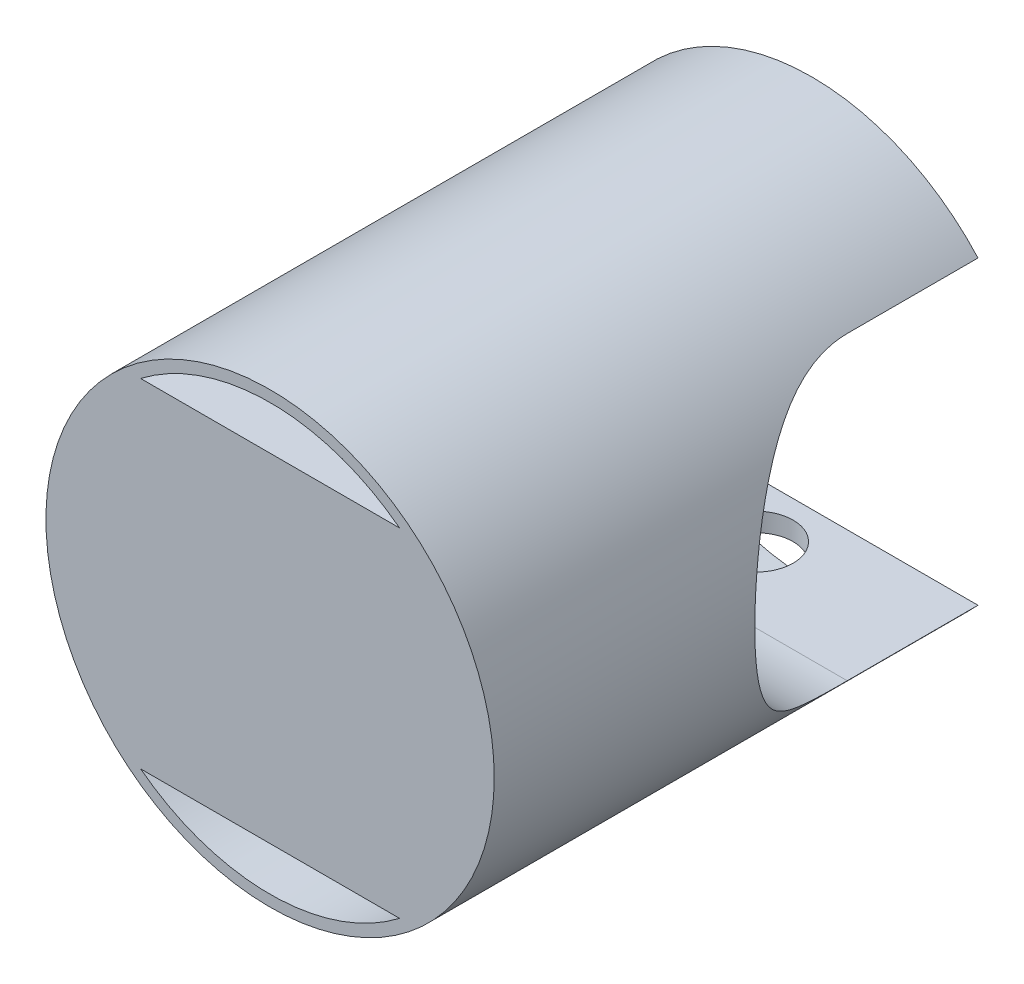
ISO-10303-21;
HEADER;
FILE_DESCRIPTION(('STEP AP214'),'2;1');
FILE_NAME('part.step','',(''),(''),'','','');
FILE_SCHEMA(('AUTOMOTIVE_DESIGN { 1 0 10303 214 1 1 1 1 }'));
ENDSEC;
DATA;
#1=APPLICATION_CONTEXT('core data for automotive mechanical design processes');
#2=APPLICATION_PROTOCOL_DEFINITION('international standard','automotive_design',2000,#1);
#3=PRODUCT_CONTEXT('',#1,'mechanical');
#4=PRODUCT('Part','Part','',(#3));
#5=PRODUCT_RELATED_PRODUCT_CATEGORY('part','',(#4));
#6=PRODUCT_DEFINITION_FORMATION('','',#4);
#7=PRODUCT_DEFINITION_CONTEXT('part definition',#1,'design');
#8=PRODUCT_DEFINITION('design','',#6,#7);
#9=PRODUCT_DEFINITION_SHAPE('','',#8);
#10=(LENGTH_UNIT() NAMED_UNIT(*) SI_UNIT(.MILLI.,.METRE.));
#11=(NAMED_UNIT(*) PLANE_ANGLE_UNIT() SI_UNIT($,.RADIAN.));
#12=(NAMED_UNIT(*) SI_UNIT($,.STERADIAN.) SOLID_ANGLE_UNIT());
#13=UNCERTAINTY_MEASURE_WITH_UNIT(LENGTH_MEASURE(1.E-05),#10,'distance_accuracy_value','');
#14=(GEOMETRIC_REPRESENTATION_CONTEXT(3) GLOBAL_UNCERTAINTY_ASSIGNED_CONTEXT((#13)) GLOBAL_UNIT_ASSIGNED_CONTEXT((#10,
#11,#12)) REPRESENTATION_CONTEXT('',''));
#15=CARTESIAN_POINT('',(0.,0.,0.));
#16=DIRECTION('',(0.,0.,1.));
#17=DIRECTION('',(1.,0.,0.));
#18=AXIS2_PLACEMENT_3D('',#15,#16,#17);
#19=CARTESIAN_POINT('',(0.,0.,0.));
#20=DIRECTION('',(0.,0.,1.));
#21=DIRECTION('',(1.,0.,0.));
#22=AXIS2_PLACEMENT_3D('',#19,#20,#21);
#23=PLANE('',#22);
#24=CARTESIAN_POINT('',(0.,0.,0.));
#25=DIRECTION('',(0.,0.,-1.));
#26=DIRECTION('',(-1.,0.,0.));
#27=AXIS2_PLACEMENT_3D('',#24,#25,#26);
#28=CIRCLE('',#27,57.);
#29=CARTESIAN_POINT('',(-34.6617584666445,45.25,0.));
#30=VERTEX_POINT('',#29);
#31=CARTESIAN_POINT('',(34.6617584666445,45.25,0.));
#32=VERTEX_POINT('',#31);
#33=EDGE_CURVE('E126',#30,#32,#28,.T.);
#34=ORIENTED_EDGE('',*,*,#33,.F.);
#35=DIRECTION('',(-1.,0.,0.));
#36=VECTOR('',#35,1.);
#37=CARTESIAN_POINT('',(34.6617584666445,45.25,0.));
#38=LINE('',#37,#36);
#39=EDGE_CURVE('E123',#32,#30,#38,.T.);
#40=ORIENTED_EDGE('',*,*,#39,.F.);
#41=EDGE_LOOP('',(#34,#40));
#42=FACE_BOUND('',#41,.T.);
#43=CARTESIAN_POINT('',(0.,0.,0.));
#44=DIRECTION('',(0.,0.,1.));
#45=DIRECTION('',(1.,0.,0.));
#46=AXIS2_PLACEMENT_3D('',#43,#44,#45);
#47=CIRCLE('',#46,60.);
#48=CARTESIAN_POINT('',(44.4964886255084,40.25,0.));
#49=VERTEX_POINT('',#48);
#50=CARTESIAN_POINT('',(-44.4964886255084,40.25,0.));
#51=VERTEX_POINT('',#50);
#52=EDGE_CURVE('E191',#49,#51,#47,.T.);
#53=ORIENTED_EDGE('',*,*,#52,.F.);
#54=DIRECTION('',(-1.,0.,0.));
#55=VECTOR('',#54,1.);
#56=CARTESIAN_POINT('',(0.,40.25,0.));
#57=LINE('',#56,#55);
#58=EDGE_CURVE('E12',#49,#51,#57,.T.);
#59=ORIENTED_EDGE('',*,*,#58,.T.);
#60=EDGE_LOOP('',(#53,#59));
#61=FACE_BOUND('',#60,.T.);
#62=ADVANCED_FACE('F37',(#42,#61),#23,.F.);
#63=CARTESIAN_POINT('',(0.,0.,145.));
#64=DIRECTION('',(0.,0.,-1.));
#65=DIRECTION('',(-1.,0.,0.));
#66=AXIS2_PLACEMENT_3D('',#63,#64,#65);
#67=CYLINDRICAL_SURFACE('',#66,60.);
#68=CARTESIAN_POINT('',(0.,0.,145.));
#69=DIRECTION('',(0.,0.,1.));
#70=DIRECTION('',(1.,0.,0.));
#71=AXIS2_PLACEMENT_3D('',#68,#69,#70);
#72=CIRCLE('',#71,60.);
#73=CARTESIAN_POINT('',(60.,0.,145.));
#74=VERTEX_POINT('',#73);
#75=EDGE_CURVE('E195',#74,#74,#72,.T.);
#76=ORIENTED_EDGE('',*,*,#75,.F.);
#77=EDGE_LOOP('',(#76));
#78=FACE_BOUND('',#77,.T.);
#79=DIRECTION('',(0.,0.,-1.));
#80=VECTOR('',#79,1.);
#81=CARTESIAN_POINT('',(44.4964886255084,-40.25,145.));
#82=LINE('',#81,#80);
#83=CARTESIAN_POINT('',(44.4964886255084,-40.25,0.));
#84=VERTEX_POINT('',#83);
#85=CARTESIAN_POINT('',(44.4964886255084,-40.25,35.));
#86=VERTEX_POINT('',#85);
#87=EDGE_CURVE('E306',#84,#86,#82,.F.);
#88=ORIENTED_EDGE('',*,*,#87,.T.);
#89=CARTESIAN_POINT('',(56.6121674200873,-19.876179210301,0.));
#90=CARTESIAN_POINT('',(56.4285483857352,-20.3991968551922,0.297017410278698));
#91=CARTESIAN_POINT('',(56.2396155302243,-20.9141095731327,0.604935251371691));
#92=CARTESIAN_POINT('',(55.8524404175049,-21.9271204918952,1.24171555344466));
#93=CARTESIAN_POINT('',(55.65419932269,-22.4252207789359,1.57057540104813));
#94=CARTESIAN_POINT('',(55.2498049085058,-23.4038294570921,2.24824785957044));
#95=CARTESIAN_POINT('',(55.0436565676444,-23.8843485568983,2.59704798153675));
#96=CARTESIAN_POINT('',(54.624665633305,-24.8276531022003,3.31402244113186));
#97=CARTESIAN_POINT('',(54.4118228127954,-25.2904379450861,3.68219743611172));
#98=CARTESIAN_POINT('',(53.7635935084474,-26.655059248488,4.81764974835915));
#99=CARTESIAN_POINT('',(53.3199898409441,-27.5296116386248,5.61339050635485));
#100=CARTESIAN_POINT('',(52.4222732479844,-29.2028640449012,7.27552297692947));
#101=CARTESIAN_POINT('',(51.9681585249434,-30.0015509656486,8.14192683910469));
#102=CARTESIAN_POINT('',(51.0620093339662,-31.5190513891649,9.94020060796596));
#103=CARTESIAN_POINT('',(50.6099726277779,-32.2380004605289,10.8719548624543));
#104=CARTESIAN_POINT('',(49.7199227474177,-33.5944542570955,12.799458866608));
#105=CARTESIAN_POINT('',(49.281910410849,-34.2319541245325,13.7952124279796));
#106=CARTESIAN_POINT('',(48.4348218081038,-35.4203268580078,15.8462722608049));
#107=CARTESIAN_POINT('',(48.0256954242742,-35.9713518979309,16.9014693752266));
#108=CARTESIAN_POINT('',(47.2513043066325,-36.9826974905988,19.0697681041894));
#109=CARTESIAN_POINT('',(46.8860224992722,-37.4430533959266,20.1828469353773));
#110=CARTESIAN_POINT('',(46.3088162617164,-38.1528680357539,22.1473432494696));
#111=CARTESIAN_POINT('',(46.082390327738,-38.4254668323672,22.986193570467));
#112=CARTESIAN_POINT('',(45.6681130138683,-38.9169221696185,24.6888234825464));
#113=CARTESIAN_POINT('',(45.4802554256875,-39.1357873607878,25.5525990358795));
#114=CARTESIAN_POINT('',(45.1497120143624,-39.5166696979882,27.2997772001098));
#115=CARTESIAN_POINT('',(45.0069588768451,-39.6787715976975,28.1831484371834));
#116=CARTESIAN_POINT('',(44.7716957220805,-39.9440466056761,29.9654034928346));
#117=CARTESIAN_POINT('',(44.6791857910996,-40.0472196127657,30.8642873380443));
#118=CARTESIAN_POINT('',(44.5479339486506,-40.1931761038563,32.6759201846978));
#119=CARTESIAN_POINT('',(44.5094910213854,-40.2356238060399,33.5887182867174));
#120=CARTESIAN_POINT('',(44.4890546779295,-40.2582198306434,35.4157232803552));
#121=CARTESIAN_POINT('',(44.5070610340189,-40.2383684043819,36.3299301662754));
#122=CARTESIAN_POINT('',(44.5987319890555,-40.1367375030638,38.1525190188344));
#123=CARTESIAN_POINT('',(44.6724256380468,-40.0549257054754,39.0608976955944));
#124=CARTESIAN_POINT('',(44.8723049283059,-39.8308754618947,40.8642608348384));
#125=CARTESIAN_POINT('',(44.9984912446347,-39.6886362387992,41.7592451249159));
#126=CARTESIAN_POINT('',(45.2881630958885,-39.3576813192131,43.4701125681586));
#127=CARTESIAN_POINT('',(45.4485611063814,-39.1727446860708,44.2872611920567));
#128=CARTESIAN_POINT('',(45.805629320023,-38.7546107784974,45.9012818571936));
#129=CARTESIAN_POINT('',(46.0023130054617,-38.5213955617508,46.6981462359757));
#130=CARTESIAN_POINT('',(46.4266025861275,-38.0089615683636,48.2689208286725));
#131=CARTESIAN_POINT('',(46.6542247797258,-37.729718527714,49.042818680277));
#132=CARTESIAN_POINT('',(47.1347802062285,-37.1276294332503,50.5650764867693));
#133=CARTESIAN_POINT('',(47.3877091108621,-36.8047908324039,51.313440779465));
#134=CARTESIAN_POINT('',(48.0361462722413,-35.9573431836533,53.125847774607));
#135=CARTESIAN_POINT('',(48.4432094611655,-35.4087750400647,54.1746405505479));
#136=CARTESIAN_POINT('',(49.2851236964855,-34.2272278496484,56.2119550238371));
#137=CARTESIAN_POINT('',(49.7199847092351,-33.5942184386857,57.2004548533129));
#138=CARTESIAN_POINT('',(50.6042954697672,-32.2467931581885,59.115969822394));
#139=CARTESIAN_POINT('',(51.0537670349988,-31.5322511307619,60.0428860676285));
#140=CARTESIAN_POINT('',(51.9540436624452,-30.0257778775863,61.8306048948545));
#141=CARTESIAN_POINT('',(52.4048485680261,-29.2338554172623,62.6914149454755));
#142=CARTESIAN_POINT('',(53.300382114869,-27.5675906984714,64.3510765149974));
#143=CARTESIAN_POINT('',(53.7450171694337,-26.6925594332889,65.1492877082238));
#144=CARTESIAN_POINT('',(54.6127497111428,-24.8689994712765,66.6702532420554));
#145=CARTESIAN_POINT('',(55.0358452850668,-23.9204642643483,67.393000885666));
#146=CARTESIAN_POINT('',(55.8491007793372,-21.9546786581219,68.756233913099));
#147=CARTESIAN_POINT('',(56.2393029534692,-20.9375195325443,69.3968254013953));
#148=CARTESIAN_POINT('',(56.9768348691476,-18.8381782880014,70.589915224687));
#149=CARTESIAN_POINT('',(57.3241775417427,-17.7560159282485,71.1424401448077));
#150=CARTESIAN_POINT('',(57.8993856284153,-15.7639460063394,72.0472188804841));
#151=CARTESIAN_POINT('',(58.1370857276616,-14.8649070676305,72.4172374477336));
#152=CARTESIAN_POINT('',(58.5747054665322,-13.0341573657777,73.0936372906333));
#153=CARTESIAN_POINT('',(58.7746258594106,-12.1024472544731,73.4000198350748));
#154=CARTESIAN_POINT('',(59.1320985026057,-10.2135639115356,73.9449583467922));
#155=CARTESIAN_POINT('',(59.2897375823867,-9.25644736958731,74.1836533767052));
#156=CARTESIAN_POINT('',(59.5596321620036,-7.32146901538629,74.5908519445067));
#157=CARTESIAN_POINT('',(59.671906462071,-6.34361597402117,74.7593845602299));
#158=CARTESIAN_POINT('',(59.8396198961242,-4.47327128093725,75.0106288446402));
#159=CARTESIAN_POINT('',(59.8996529523029,-3.58212953300829,75.1002875307769));
#160=CARTESIAN_POINT('',(59.9597986959427,-2.24121765769794,75.1900531428551));
#161=CARTESIAN_POINT('',(59.9748633180077,-1.79348565644577,75.2125212903075));
#162=CARTESIAN_POINT('',(59.9949673204824,-0.897190210079992,75.2424988353523));
#163=CARTESIAN_POINT('',(60.0000041219652,-0.448626580770983,75.2500043849062));
#164=CARTESIAN_POINT('',(59.9999907321107,1.00869883546825,75.2499901409102));
#165=CARTESIAN_POINT('',(59.9744977258412,2.01771591393388,75.2120147766894));
#166=CARTESIAN_POINT('',(59.8731219105941,4.02778392224378,75.0606576120595));
#167=CARTESIAN_POINT('',(59.7972166163742,5.02883109557833,74.9472421633002));
#168=CARTESIAN_POINT('',(59.5967069575439,7.01654212379433,74.6464698145842));
#169=CARTESIAN_POINT('',(59.4720208827635,8.00317894905509,74.4589888461132));
#170=CARTESIAN_POINT('',(59.1769314189136,9.9530488753232,74.0128142572442));
#171=CARTESIAN_POINT('',(59.0065324972522,10.9162842532722,73.7541275955454));
#172=CARTESIAN_POINT('',(58.6248745806264,12.8082198352237,73.1704974136423));
#173=CARTESIAN_POINT('',(58.4138389746482,13.7370771813097,72.8459156269149));
#174=CARTESIAN_POINT('',(57.9547317463339,15.5606317455798,72.13337652527));
#175=CARTESIAN_POINT('',(57.7066593487916,16.455328248261,71.7454178838142));
#176=CARTESIAN_POINT('',(57.1783902146085,18.206255487542,70.9101022984723));
#177=CARTESIAN_POINT('',(56.8982030845386,19.0624976209903,70.4627631109593));
#178=CARTESIAN_POINT('',(56.3107343225026,20.7336892714956,69.5123289492243));
#179=CARTESIAN_POINT('',(56.0034515488494,21.5486370463161,69.0092316253788));
#180=CARTESIAN_POINT('',(55.339859871988,23.2025899441206,67.9055225054802));
#181=CARTESIAN_POINT('',(54.9816052375558,24.0377047623741,67.3002520162886));
#182=CARTESIAN_POINT('',(54.2462694576579,25.6540590379,66.0320352504578));
#183=CARTESIAN_POINT('',(53.869187421728,26.4352959427838,65.3690862447419));
#184=CARTESIAN_POINT('',(53.1027654922072,27.9430204249937,63.987873844925));
#185=CARTESIAN_POINT('',(52.713409282677,28.669430360466,63.269534815718));
#186=CARTESIAN_POINT('',(51.9303567269628,30.0645652071697,61.7810579574388));
#187=CARTESIAN_POINT('',(51.5366601272559,30.7332867284626,61.0109170890668));
#188=CARTESIAN_POINT('',(50.6899707586675,32.1135926628626,59.2936201004385));
#189=CARTESIAN_POINT('',(50.2375784739818,32.8148921673922,58.3378667713325));
#190=CARTESIAN_POINT('',(49.3507654919571,34.1340566402087,56.3621136944447));
#191=CARTESIAN_POINT('',(48.9163489657668,34.751902318095,55.34209917228));
#192=CARTESIAN_POINT('',(48.0810240671121,35.8987142795218,53.2420993673649));
#193=CARTESIAN_POINT('',(47.6800704903505,36.4278014743569,52.1621983794437));
#194=CARTESIAN_POINT('',(46.9276354156672,37.3921279684375,49.9449350709158));
#195=CARTESIAN_POINT('',(46.5761298742497,37.827412933003,48.8076010445649));
#196=CARTESIAN_POINT('',(46.0330143829293,38.4848895520334,46.8207032080933));
#197=CARTESIAN_POINT('',(45.824670628363,38.7322039461542,45.9839590283238));
#198=CARTESIAN_POINT('',(45.4479451417036,39.173569976305,44.287705670776));
#199=CARTESIAN_POINT('',(45.2795568863143,39.3676303076192,43.4282002345989));
#200=CARTESIAN_POINT('',(44.988773903377,39.6996097860233,41.6920360725015));
#201=CARTESIAN_POINT('',(44.8663109161991,39.8376122785841,40.8154048578612));
#202=CARTESIAN_POINT('',(44.6717440824139,40.0556709645252,39.0493451459657));
#203=CARTESIAN_POINT('',(44.5996404648685,40.135726894333,38.15991659052));
#204=CARTESIAN_POINT('',(44.5086068946147,40.2366579989871,36.3710613390683));
#205=CARTESIAN_POINT('',(44.4899096571707,40.2572741721169,35.4716079794544));
#206=CARTESIAN_POINT('',(44.5071700887685,40.2381902758557,33.6738726788812));
#207=CARTESIAN_POINT('',(44.5431279202207,40.1984900272312,32.7755907414107));
#208=CARTESIAN_POINT('',(44.6681793459306,40.0594856245397,30.9868340258949));
#209=CARTESIAN_POINT('',(44.7573082820742,39.9601418261873,30.0963648406694));
#210=CARTESIAN_POINT('',(44.9850580191282,39.7035744497247,28.3302903913152));
#211=CARTESIAN_POINT('',(45.1236797326016,39.5463498043884,27.4546854015687));
#212=CARTESIAN_POINT('',(45.4375986243481,39.1851878143955,25.7644713160768));
#213=CARTESIAN_POINT('',(45.6108600828117,38.983800398457,24.9489321041998));
#214=CARTESIAN_POINT('',(45.9923562649402,38.5329768486945,23.3393373018182));
#215=CARTESIAN_POINT('',(46.2006044885673,38.2835221621961,22.5452901420682));
#216=CARTESIAN_POINT('',(46.6465472493671,37.7388851536678,20.9812592695182));
#217=CARTESIAN_POINT('',(46.8842525651651,37.4436860833858,20.211284494849));
#218=CARTESIAN_POINT('',(47.3834685809512,36.8099114721747,18.6976677574372));
#219=CARTESIAN_POINT('',(47.6449740260496,36.4713454996389,17.954020032002));
#220=CARTESIAN_POINT('',(48.2421993871414,35.6789036651363,16.3441668119744));
#221=CARTESIAN_POINT('',(48.5821333189095,35.215624777876,15.4841449721293));
#222=CARTESIAN_POINT('',(49.2804464793335,34.2315888110476,13.8054813526339));
#223=CARTESIAN_POINT('',(49.6388276507805,33.7108256708261,12.9868439494999));
#224=CARTESIAN_POINT('',(50.3662620335471,32.6139965094144,11.3922402028472));
#225=CARTESIAN_POINT('',(50.7353173943699,32.037919294464,10.6162825464959));
#226=CARTESIAN_POINT('',(51.4768371569815,30.8323873851258,9.10872826387857));
#227=CARTESIAN_POINT('',(51.8493016536865,30.2029312005154,8.37713287708736));
#228=CARTESIAN_POINT('',(52.6131068046369,28.8530357246391,6.91778434105236));
#229=CARTESIAN_POINT('',(53.0042463916249,28.1294078858464,6.19286974401079));
#230=CARTESIAN_POINT('',(53.7752669859669,26.6258249496406,4.79768629020559));
#231=CARTESIAN_POINT('',(54.1551490446836,25.8458751357781,4.12741232014419));
#232=CARTESIAN_POINT('',(54.8965718885925,24.2312869387278,2.84459518046804));
#233=CARTESIAN_POINT('',(55.2581110742959,23.3966438008034,2.23205704140582));
#234=CARTESIAN_POINT('',(55.7813572246065,22.1055690486584,1.35960159874037));
#235=CARTESIAN_POINT('',(55.952644755893,21.6685534202873,1.07642924972156));
#236=CARTESIAN_POINT('',(56.2880172824283,20.7818150728528,0.526083846266663));
#237=CARTESIAN_POINT('',(56.4521016704336,20.3320912876917,0.258912140037342));
#238=CARTESIAN_POINT('',(56.6121674200873,19.876179210301,0.));
#239=B_SPLINE_CURVE_WITH_KNOTS('',3,(#89,#90,#91,#92,#93,#94,#95,#96,#97,#98,#99,#100,#101,#102,
#103,#104,#105,#106,#107,#108,#109,#110,#111,#112,#113,#114,#115,#116,#117,#118,#119,#120,#121,
#122,#123,#124,#125,#126,#127,#128,#129,#130,#131,#132,#133,#134,#135,#136,#137,#138,#139,#140,
#141,#142,#143,#144,#145,#146,#147,#148,#149,#150,#151,#152,#153,#154,#155,#156,#157,#158,#159,
#160,#161,#162,#163,#164,#165,#166,#167,#168,#169,#170,#171,#172,#173,#174,#175,#176,#177,#178,
#179,#180,#181,#182,#183,#184,#185,#186,#187,#188,#189,#190,#191,#192,#193,#194,#195,#196,#197,
#198,#199,#200,#201,#202,#203,#204,#205,#206,#207,#208,#209,#210,#211,#212,#213,#214,#215,#216,
#217,#218,#219,#220,#221,#222,#223,#224,#225,#226,#227,#228,#229,#230,#231,#232,#233,#234,#235,
#236,#237,#238),.UNSPECIFIED.,.F.,.F.,(4,2,2,2,2,2,2,2,2,2,2,2,2,2,2,2,2,2,2,2,2,2,2,2,2,2,2,2,
2,2,2,2,2,2,2,2,2,2,2,2,2,2,2,2,2,2,2,2,2,2,2,2,2,2,2,2,2,2,2,2,2,2,2,2,2,2,2,2,2,2,2,2,2,2,4),
(0.,1.88639163071472,3.77254831606726,5.65753634154336,7.542588362214,11.3263562178152,
15.1107760198551,18.8886596720479,22.6667685384101,26.4381524750377,30.208062996645,
32.9375230906177,35.666543482372,38.3914716034885,41.1164044032357,43.856347295649,
46.596279134973,49.3376412850862,52.0790386904814,54.6356496093005,57.1932123815837,
59.7521277350511,62.3106061764641,66.0602911603202,69.8113281420049,73.5682500036802,
77.3247467847126,81.1156800771197,84.9069495095559,88.6932721333868,92.4784495861062,
95.4779615799507,98.4774137630164,101.470658231881,104.462660954394,107.152569453501,
108.497891614937,109.843559717894,112.86918037115,115.896151440069,118.928214691554,
121.959981734561,124.975535191654,127.991151775259,131.005868631639,134.020712575203,
137.293057123351,140.565556587772,143.842606600672,147.119849051535,150.921903929911,
154.724836156965,158.522545012384,162.318400848501,165.007129677999,167.695419232269,
170.379697141738,173.063987260685,175.759956308871,178.455933368288,181.153704395324,
183.851525167247,186.422235966301,188.993940985362,191.566589809358,194.138671983474,
197.238822799015,200.33930078099,203.440407526045,206.541600875652,209.827993230097,
213.114077688379,216.400448200723,218.044635099122,219.688960341598),.UNSPECIFIED.);
#240=CARTESIAN_POINT('',(44.4964886255084,40.25,35.));
#241=VERTEX_POINT('',#240);
#242=EDGE_CURVE('E150',#86,#241,#239,.T.);
#243=ORIENTED_EDGE('',*,*,#242,.T.);
#244=DIRECTION('',(0.,0.,-1.));
#245=VECTOR('',#244,1.);
#246=CARTESIAN_POINT('',(44.4964886255084,40.25,145.));
#247=LINE('',#246,#245);
#248=EDGE_CURVE('E201',#241,#49,#247,.T.);
#249=ORIENTED_EDGE('',*,*,#248,.T.);
#250=ORIENTED_EDGE('',*,*,#52,.T.);
#251=DIRECTION('',(0.,0.,-1.));
#252=VECTOR('',#251,1.);
#253=CARTESIAN_POINT('',(-44.4964886255084,40.25,145.));
#254=LINE('',#253,#252);
#255=CARTESIAN_POINT('',(-44.4964886255084,40.25,35.));
#256=VERTEX_POINT('',#255);
#257=EDGE_CURVE('E314',#51,#256,#254,.F.);
#258=ORIENTED_EDGE('',*,*,#257,.T.);
#259=CARTESIAN_POINT('',(-56.6121674200873,19.876179210301,0.));
#260=CARTESIAN_POINT('',(-56.4285483857352,20.3991968551922,0.297017410278698));
#261=CARTESIAN_POINT('',(-56.2396155302243,20.9141095731327,0.604935251371691));
#262=CARTESIAN_POINT('',(-55.8524404175049,21.9271204918952,1.24171555344466));
#263=CARTESIAN_POINT('',(-55.65419932269,22.4252207789359,1.57057540104813));
#264=CARTESIAN_POINT('',(-55.2498049085058,23.4038294570921,2.24824785957044));
#265=CARTESIAN_POINT('',(-55.0436565676444,23.8843485568983,2.59704798153675));
#266=CARTESIAN_POINT('',(-54.624665633305,24.8276531022003,3.31402244113186));
#267=CARTESIAN_POINT('',(-54.4118228127954,25.2904379450861,3.68219743611172));
#268=CARTESIAN_POINT('',(-53.7635935084474,26.655059248488,4.81764974835915));
#269=CARTESIAN_POINT('',(-53.3199898409441,27.5296116386248,5.61339050635485));
#270=CARTESIAN_POINT('',(-52.4222732479844,29.2028640449012,7.27552297692947));
#271=CARTESIAN_POINT('',(-51.9681585249434,30.0015509656486,8.14192683910469));
#272=CARTESIAN_POINT('',(-51.0620093339662,31.5190513891649,9.94020060796596));
#273=CARTESIAN_POINT('',(-50.6099726277779,32.2380004605289,10.8719548624543));
#274=CARTESIAN_POINT('',(-49.7199227474177,33.5944542570955,12.799458866608));
#275=CARTESIAN_POINT('',(-49.281910410849,34.2319541245325,13.7952124279796));
#276=CARTESIAN_POINT('',(-48.4348218081038,35.4203268580078,15.8462722608049));
#277=CARTESIAN_POINT('',(-48.0256954242742,35.9713518979309,16.9014693752266));
#278=CARTESIAN_POINT('',(-47.2513043066325,36.9826974905988,19.0697681041894));
#279=CARTESIAN_POINT('',(-46.8860224992722,37.4430533959266,20.1828469353773));
#280=CARTESIAN_POINT('',(-46.3088162617164,38.1528680357539,22.1473432494696));
#281=CARTESIAN_POINT('',(-46.082390327738,38.4254668323672,22.986193570467));
#282=CARTESIAN_POINT('',(-45.6681130138683,38.9169221696185,24.6888234825464));
#283=CARTESIAN_POINT('',(-45.4802554256875,39.1357873607878,25.5525990358795));
#284=CARTESIAN_POINT('',(-45.1497120143624,39.5166696979882,27.2997772001098));
#285=CARTESIAN_POINT('',(-45.0069588768451,39.6787715976975,28.1831484371834));
#286=CARTESIAN_POINT('',(-44.7716957220805,39.9440466056761,29.9654034928346));
#287=CARTESIAN_POINT('',(-44.6791857910996,40.0472196127657,30.8642873380443));
#288=CARTESIAN_POINT('',(-44.5479339486506,40.1931761038563,32.6759201846978));
#289=CARTESIAN_POINT('',(-44.5094910213854,40.2356238060399,33.5887182867174));
#290=CARTESIAN_POINT('',(-44.4890546779295,40.2582198306434,35.4157232803552));
#291=CARTESIAN_POINT('',(-44.5070610340189,40.2383684043819,36.3299301662754));
#292=CARTESIAN_POINT('',(-44.5987319890555,40.1367375030638,38.1525190188344));
#293=CARTESIAN_POINT('',(-44.6724256380468,40.0549257054754,39.0608976955944));
#294=CARTESIAN_POINT('',(-44.8723049283059,39.8308754618947,40.8642608348384));
#295=CARTESIAN_POINT('',(-44.9984912446347,39.6886362387992,41.7592451249159));
#296=CARTESIAN_POINT('',(-45.2881630958885,39.3576813192131,43.4701125681586));
#297=CARTESIAN_POINT('',(-45.4485611063814,39.1727446860708,44.2872611920567));
#298=CARTESIAN_POINT('',(-45.805629320023,38.7546107784974,45.9012818571936));
#299=CARTESIAN_POINT('',(-46.0023130054617,38.5213955617508,46.6981462359757));
#300=CARTESIAN_POINT('',(-46.4266025861275,38.0089615683636,48.2689208286725));
#301=CARTESIAN_POINT('',(-46.6542247797258,37.729718527714,49.042818680277));
#302=CARTESIAN_POINT('',(-47.1347802062285,37.1276294332503,50.5650764867693));
#303=CARTESIAN_POINT('',(-47.3877091108621,36.8047908324039,51.313440779465));
#304=CARTESIAN_POINT('',(-48.0361462722413,35.9573431836533,53.125847774607));
#305=CARTESIAN_POINT('',(-48.4432094611655,35.4087750400647,54.1746405505479));
#306=CARTESIAN_POINT('',(-49.2851236964855,34.2272278496484,56.2119550238371));
#307=CARTESIAN_POINT('',(-49.7199847092351,33.5942184386857,57.2004548533129));
#308=CARTESIAN_POINT('',(-50.6042954697672,32.2467931581885,59.115969822394));
#309=CARTESIAN_POINT('',(-51.0537670349988,31.5322511307619,60.0428860676285));
#310=CARTESIAN_POINT('',(-51.9540436624452,30.0257778775863,61.8306048948545));
#311=CARTESIAN_POINT('',(-52.4048485680261,29.2338554172623,62.6914149454755));
#312=CARTESIAN_POINT('',(-53.300382114869,27.5675906984714,64.3510765149974));
#313=CARTESIAN_POINT('',(-53.7450171694337,26.6925594332889,65.1492877082238));
#314=CARTESIAN_POINT('',(-54.6127497111428,24.8689994712765,66.6702532420554));
#315=CARTESIAN_POINT('',(-55.0358452850668,23.9204642643483,67.393000885666));
#316=CARTESIAN_POINT('',(-55.8491007793372,21.9546786581219,68.756233913099));
#317=CARTESIAN_POINT('',(-56.2393029534692,20.9375195325443,69.3968254013953));
#318=CARTESIAN_POINT('',(-56.9768348691476,18.8381782880014,70.589915224687));
#319=CARTESIAN_POINT('',(-57.3241775417427,17.7560159282485,71.1424401448077));
#320=CARTESIAN_POINT('',(-57.8993856284153,15.7639460063394,72.0472188804841));
#321=CARTESIAN_POINT('',(-58.1370857276616,14.8649070676305,72.4172374477336));
#322=CARTESIAN_POINT('',(-58.5747054665322,13.0341573657777,73.0936372906333));
#323=CARTESIAN_POINT('',(-58.7746258594106,12.1024472544731,73.4000198350748));
#324=CARTESIAN_POINT('',(-59.1320985026057,10.2135639115356,73.9449583467922));
#325=CARTESIAN_POINT('',(-59.2897375823867,9.25644736958731,74.1836533767052));
#326=CARTESIAN_POINT('',(-59.5596321620036,7.32146901538629,74.5908519445067));
#327=CARTESIAN_POINT('',(-59.671906462071,6.34361597402117,74.7593845602299));
#328=CARTESIAN_POINT('',(-59.8396198961242,4.47327128093725,75.0106288446402));
#329=CARTESIAN_POINT('',(-59.8996529523029,3.58212953300829,75.1002875307769));
#330=CARTESIAN_POINT('',(-59.9597986959427,2.24121765769794,75.1900531428551));
#331=CARTESIAN_POINT('',(-59.9748633180077,1.79348565644577,75.2125212903075));
#332=CARTESIAN_POINT('',(-59.9949673204824,0.897190210079992,75.2424988353523));
#333=CARTESIAN_POINT('',(-60.0000041219652,0.448626580770983,75.2500043849062));
#334=CARTESIAN_POINT('',(-59.9999907321107,-1.00869883546825,75.2499901409102));
#335=CARTESIAN_POINT('',(-59.9744977258412,-2.01771591393388,75.2120147766894));
#336=CARTESIAN_POINT('',(-59.8731219105941,-4.02778392224378,75.0606576120595));
#337=CARTESIAN_POINT('',(-59.7972166163742,-5.02883109557833,74.9472421633002));
#338=CARTESIAN_POINT('',(-59.5967069575439,-7.01654212379433,74.6464698145842));
#339=CARTESIAN_POINT('',(-59.4720208827635,-8.00317894905509,74.4589888461132));
#340=CARTESIAN_POINT('',(-59.1769314189136,-9.9530488753232,74.0128142572442));
#341=CARTESIAN_POINT('',(-59.0065324972522,-10.9162842532722,73.7541275955454));
#342=CARTESIAN_POINT('',(-58.6248745806264,-12.8082198352237,73.1704974136423));
#343=CARTESIAN_POINT('',(-58.4138389746482,-13.7370771813097,72.8459156269149));
#344=CARTESIAN_POINT('',(-57.9547317463339,-15.5606317455798,72.13337652527));
#345=CARTESIAN_POINT('',(-57.7066593487916,-16.455328248261,71.7454178838142));
#346=CARTESIAN_POINT('',(-57.1783902146085,-18.206255487542,70.9101022984723));
#347=CARTESIAN_POINT('',(-56.8982030845386,-19.0624976209903,70.4627631109593));
#348=CARTESIAN_POINT('',(-56.3107343225026,-20.7336892714956,69.5123289492243));
#349=CARTESIAN_POINT('',(-56.0034515488494,-21.5486370463161,69.0092316253788));
#350=CARTESIAN_POINT('',(-55.339859871988,-23.2025899441206,67.9055225054802));
#351=CARTESIAN_POINT('',(-54.9816052375558,-24.0377047623741,67.3002520162886));
#352=CARTESIAN_POINT('',(-54.2462694576579,-25.6540590379,66.0320352504578));
#353=CARTESIAN_POINT('',(-53.869187421728,-26.4352959427838,65.3690862447419));
#354=CARTESIAN_POINT('',(-53.1027654922072,-27.9430204249937,63.987873844925));
#355=CARTESIAN_POINT('',(-52.713409282677,-28.669430360466,63.269534815718));
#356=CARTESIAN_POINT('',(-51.9303567269628,-30.0645652071697,61.7810579574388));
#357=CARTESIAN_POINT('',(-51.5366601272559,-30.7332867284626,61.0109170890668));
#358=CARTESIAN_POINT('',(-50.6899707586675,-32.1135926628626,59.2936201004385));
#359=CARTESIAN_POINT('',(-50.2375784739818,-32.8148921673922,58.3378667713325));
#360=CARTESIAN_POINT('',(-49.3507654919571,-34.1340566402087,56.3621136944447));
#361=CARTESIAN_POINT('',(-48.9163489657668,-34.751902318095,55.34209917228));
#362=CARTESIAN_POINT('',(-48.0810240671121,-35.8987142795218,53.2420993673649));
#363=CARTESIAN_POINT('',(-47.6800704903505,-36.4278014743569,52.1621983794437));
#364=CARTESIAN_POINT('',(-46.9276354156672,-37.3921279684375,49.9449350709158));
#365=CARTESIAN_POINT('',(-46.5761298742497,-37.827412933003,48.8076010445649));
#366=CARTESIAN_POINT('',(-46.0330143829293,-38.4848895520334,46.8207032080933));
#367=CARTESIAN_POINT('',(-45.824670628363,-38.7322039461542,45.9839590283238));
#368=CARTESIAN_POINT('',(-45.4479451417036,-39.173569976305,44.287705670776));
#369=CARTESIAN_POINT('',(-45.2795568863143,-39.3676303076192,43.4282002345989));
#370=CARTESIAN_POINT('',(-44.988773903377,-39.6996097860233,41.6920360725015));
#371=CARTESIAN_POINT('',(-44.8663109161991,-39.8376122785841,40.8154048578612));
#372=CARTESIAN_POINT('',(-44.6717440824139,-40.0556709645252,39.0493451459657));
#373=CARTESIAN_POINT('',(-44.5996404648685,-40.135726894333,38.15991659052));
#374=CARTESIAN_POINT('',(-44.5086068946147,-40.2366579989871,36.3710613390683));
#375=CARTESIAN_POINT('',(-44.4899096571707,-40.2572741721169,35.4716079794544));
#376=CARTESIAN_POINT('',(-44.5071700887685,-40.2381902758557,33.6738726788812));
#377=CARTESIAN_POINT('',(-44.5431279202207,-40.1984900272312,32.7755907414107));
#378=CARTESIAN_POINT('',(-44.6681793459306,-40.0594856245397,30.9868340258949));
#379=CARTESIAN_POINT('',(-44.7573082820742,-39.9601418261873,30.0963648406694));
#380=CARTESIAN_POINT('',(-44.9850580191282,-39.7035744497247,28.3302903913152));
#381=CARTESIAN_POINT('',(-45.1236797326016,-39.5463498043884,27.4546854015687));
#382=CARTESIAN_POINT('',(-45.4375986243481,-39.1851878143955,25.7644713160768));
#383=CARTESIAN_POINT('',(-45.6108600828117,-38.983800398457,24.9489321041998));
#384=CARTESIAN_POINT('',(-45.9923562649402,-38.5329768486945,23.3393373018182));
#385=CARTESIAN_POINT('',(-46.2006044885673,-38.2835221621961,22.5452901420682));
#386=CARTESIAN_POINT('',(-46.6465472493671,-37.7388851536678,20.9812592695182));
#387=CARTESIAN_POINT('',(-46.8842525651651,-37.4436860833858,20.211284494849));
#388=CARTESIAN_POINT('',(-47.3834685809512,-36.8099114721747,18.6976677574372));
#389=CARTESIAN_POINT('',(-47.6449740260496,-36.4713454996389,17.954020032002));
#390=CARTESIAN_POINT('',(-48.2421993871414,-35.6789036651363,16.3441668119744));
#391=CARTESIAN_POINT('',(-48.5821333189095,-35.215624777876,15.4841449721293));
#392=CARTESIAN_POINT('',(-49.2804464793335,-34.2315888110476,13.8054813526339));
#393=CARTESIAN_POINT('',(-49.6388276507805,-33.7108256708261,12.9868439494999));
#394=CARTESIAN_POINT('',(-50.3662620335471,-32.6139965094144,11.3922402028472));
#395=CARTESIAN_POINT('',(-50.7353173943699,-32.037919294464,10.6162825464959));
#396=CARTESIAN_POINT('',(-51.4768371569815,-30.8323873851258,9.10872826387857));
#397=CARTESIAN_POINT('',(-51.8493016536865,-30.2029312005154,8.37713287708736));
#398=CARTESIAN_POINT('',(-52.6131068046369,-28.8530357246391,6.91778434105236));
#399=CARTESIAN_POINT('',(-53.0042463916249,-28.1294078858464,6.19286974401079));
#400=CARTESIAN_POINT('',(-53.7752669859669,-26.6258249496406,4.79768629020559));
#401=CARTESIAN_POINT('',(-54.1551490446836,-25.8458751357781,4.12741232014419));
#402=CARTESIAN_POINT('',(-54.8965718885925,-24.2312869387278,2.84459518046804));
#403=CARTESIAN_POINT('',(-55.2581110742959,-23.3966438008034,2.23205704140582));
#404=CARTESIAN_POINT('',(-55.7813572246065,-22.1055690486584,1.35960159874037));
#405=CARTESIAN_POINT('',(-55.952644755893,-21.6685534202873,1.07642924972156));
#406=CARTESIAN_POINT('',(-56.2880172824283,-20.7818150728528,0.526083846266663));
#407=CARTESIAN_POINT('',(-56.4521016704336,-20.3320912876917,0.258912140037342));
#408=CARTESIAN_POINT('',(-56.6121674200873,-19.876179210301,0.));
#409=B_SPLINE_CURVE_WITH_KNOTS('',3,(#259,#260,#261,#262,#263,#264,#265,#266,#267,#268,#269,
#270,#271,#272,#273,#274,#275,#276,#277,#278,#279,#280,#281,#282,#283,#284,#285,#286,#287,#288,
#289,#290,#291,#292,#293,#294,#295,#296,#297,#298,#299,#300,#301,#302,#303,#304,#305,#306,#307,
#308,#309,#310,#311,#312,#313,#314,#315,#316,#317,#318,#319,#320,#321,#322,#323,#324,#325,#326,
#327,#328,#329,#330,#331,#332,#333,#334,#335,#336,#337,#338,#339,#340,#341,#342,#343,#344,#345,
#346,#347,#348,#349,#350,#351,#352,#353,#354,#355,#356,#357,#358,#359,#360,#361,#362,#363,#364,
#365,#366,#367,#368,#369,#370,#371,#372,#373,#374,#375,#376,#377,#378,#379,#380,#381,#382,#383,
#384,#385,#386,#387,#388,#389,#390,#391,#392,#393,#394,#395,#396,#397,#398,#399,#400,#401,#402,
#403,#404,#405,#406,#407,#408),.UNSPECIFIED.,.F.,.F.,(4,2,2,2,2,2,2,2,2,2,2,2,2,2,2,2,2,2,2,2,2,
2,2,2,2,2,2,2,2,2,2,2,2,2,2,2,2,2,2,2,2,2,2,2,2,2,2,2,2,2,2,2,2,2,2,2,2,2,2,2,2,2,2,2,2,2,2,2,2,
2,2,2,2,2,4),(0.,1.88639163071472,3.77254831606726,5.65753634154336,7.542588362214,
11.3263562178152,15.1107760198551,18.8886596720479,22.6667685384101,26.4381524750377,
30.208062996645,32.9375230906177,35.666543482372,38.3914716034885,41.1164044032357,
43.856347295649,46.596279134973,49.3376412850862,52.0790386904814,54.6356496093005,
57.1932123815837,59.7521277350511,62.3106061764641,66.0602911603202,69.8113281420049,
73.5682500036802,77.3247467847126,81.1156800771197,84.9069495095559,88.6932721333868,
92.4784495861062,95.4779615799507,98.4774137630164,101.470658231881,104.462660954394,
107.152569453501,108.497891614937,109.843559717894,112.86918037115,115.896151440069,
118.928214691554,121.959981734561,124.975535191654,127.991151775259,131.005868631639,
134.020712575203,137.293057123351,140.565556587772,143.842606600672,147.119849051535,
150.921903929911,154.724836156965,158.522545012384,162.318400848501,165.007129677999,
167.695419232269,170.379697141738,173.063987260685,175.759956308871,178.455933368288,
181.153704395324,183.851525167247,186.422235966301,188.993940985362,191.566589809358,
194.138671983474,197.238822799015,200.33930078099,203.440407526045,206.541600875652,
209.827993230097,213.114077688379,216.400448200723,218.044635099122,219.688960341598),.UNSPECIFIED.);
#410=CARTESIAN_POINT('',(-44.4964886255084,-40.25,35.));
#411=VERTEX_POINT('',#410);
#412=EDGE_CURVE('E143',#256,#411,#409,.T.);
#413=ORIENTED_EDGE('',*,*,#412,.T.);
#414=DIRECTION('',(0.,0.,-1.));
#415=VECTOR('',#414,1.);
#416=CARTESIAN_POINT('',(-44.4964886255084,-40.25,145.));
#417=LINE('',#416,#415);
#418=CARTESIAN_POINT('',(-44.4964886255084,-40.25,0.));
#419=VERTEX_POINT('',#418);
#420=EDGE_CURVE('E308',#411,#419,#417,.T.);
#421=ORIENTED_EDGE('',*,*,#420,.T.);
#422=EDGE_CURVE('E196',#419,#84,#47,.T.);
#423=ORIENTED_EDGE('',*,*,#422,.T.);
#424=EDGE_LOOP('',(#88,#243,#249,#250,#258,#413,#421,#423));
#425=FACE_BOUND('',#424,.T.);
#426=ADVANCED_FACE('F39',(#78,#425),#67,.T.);
#427=CARTESIAN_POINT('',(0.,0.,145.));
#428=DIRECTION('',(0.,0.,1.));
#429=DIRECTION('',(1.,0.,0.));
#430=AXIS2_PLACEMENT_3D('',#427,#428,#429);
#431=PLANE('',#430);
#432=DIRECTION('',(1.,0.,0.));
#433=VECTOR('',#432,1.);
#434=CARTESIAN_POINT('',(34.6617584666445,-45.25,145.));
#435=LINE('',#434,#433);
#436=CARTESIAN_POINT('',(-34.6617584666445,-45.25,145.));
#437=VERTEX_POINT('',#436);
#438=CARTESIAN_POINT('',(34.6617584666445,-45.25,145.));
#439=VERTEX_POINT('',#438);
#440=EDGE_CURVE('E113',#437,#439,#435,.T.);
#441=ORIENTED_EDGE('',*,*,#440,.T.);
#442=CARTESIAN_POINT('',(0.,0.,145.));
#443=DIRECTION('',(0.,0.,1.));
#444=DIRECTION('',(1.,0.,0.));
#445=AXIS2_PLACEMENT_3D('',#442,#443,#444);
#446=CIRCLE('',#445,57.);
#447=EDGE_CURVE('E104',#439,#437,#446,.F.);
#448=ORIENTED_EDGE('',*,*,#447,.T.);
#449=EDGE_LOOP('',(#441,#448));
#450=FACE_BOUND('',#449,.T.);
#451=DIRECTION('',(-1.,0.,0.));
#452=VECTOR('',#451,1.);
#453=CARTESIAN_POINT('',(34.6617584666445,45.25,145.));
#454=LINE('',#453,#452);
#455=CARTESIAN_POINT('',(34.6617584666445,45.25,145.));
#456=VERTEX_POINT('',#455);
#457=CARTESIAN_POINT('',(-34.6617584666445,45.25,145.));
#458=VERTEX_POINT('',#457);
#459=EDGE_CURVE('E125',#456,#458,#454,.T.);
#460=ORIENTED_EDGE('',*,*,#459,.T.);
#461=CARTESIAN_POINT('',(0.,0.,145.));
#462=DIRECTION('',(0.,0.,1.));
#463=DIRECTION('',(1.,0.,0.));
#464=AXIS2_PLACEMENT_3D('',#461,#462,#463);
#465=CIRCLE('',#464,57.);
#466=EDGE_CURVE('E132',#458,#456,#465,.F.);
#467=ORIENTED_EDGE('',*,*,#466,.T.);
#468=EDGE_LOOP('',(#460,#467));
#469=FACE_BOUND('',#468,.T.);
#470=ORIENTED_EDGE('',*,*,#75,.T.);
#471=EDGE_LOOP('',(#470));
#472=FACE_BOUND('',#471,.T.);
#473=ADVANCED_FACE('F115',(#450,#469,#472),#431,.T.);
#474=CARTESIAN_POINT('',(0.,0.,0.));
#475=DIRECTION('',(0.,0.,-1.));
#476=DIRECTION('',(-1.,0.,0.));
#477=AXIS2_PLACEMENT_3D('',#474,#475,#476);
#478=CIRCLE('',#477,57.);
#479=CARTESIAN_POINT('',(34.6617584666445,-45.25,0.));
#480=VERTEX_POINT('',#479);
#481=CARTESIAN_POINT('',(-34.6617584666445,-45.25,0.));
#482=VERTEX_POINT('',#481);
#483=EDGE_CURVE('E118',#480,#482,#478,.T.);
#484=ORIENTED_EDGE('',*,*,#483,.F.);
#485=DIRECTION('',(1.,0.,0.));
#486=VECTOR('',#485,1.);
#487=CARTESIAN_POINT('',(34.6617584666445,-45.25,0.));
#488=LINE('',#487,#486);
#489=EDGE_CURVE('E62',#482,#480,#488,.T.);
#490=ORIENTED_EDGE('',*,*,#489,.F.);
#491=EDGE_LOOP('',(#484,#490));
#492=FACE_BOUND('',#491,.T.);
#493=ORIENTED_EDGE('',*,*,#422,.F.);
#494=DIRECTION('',(1.,0.,0.));
#495=VECTOR('',#494,1.);
#496=CARTESIAN_POINT('',(0.,-40.25,0.));
#497=LINE('',#496,#495);
#498=EDGE_CURVE('E47',#419,#84,#497,.T.);
#499=ORIENTED_EDGE('',*,*,#498,.T.);
#500=EDGE_LOOP('',(#493,#499));
#501=FACE_BOUND('',#500,.T.);
#502=ADVANCED_FACE('F169',(#492,#501),#23,.F.);
#503=CARTESIAN_POINT('',(-60.,40.25,35.));
#504=DIRECTION('',(0.,1.,0.));
#505=DIRECTION('',(0.,0.,1.));
#506=AXIS2_PLACEMENT_3D('',#503,#504,#505);
#507=PLANE('',#506);
#508=CARTESIAN_POINT('',(0.,40.25,15.));
#509=DIRECTION('',(0.,1.,0.));
#510=DIRECTION('',(0.,0.,1.));
#511=AXIS2_PLACEMENT_3D('',#508,#509,#510);
#512=CIRCLE('',#511,10.);
#513=CARTESIAN_POINT('',(0.,40.25,25.));
#514=VERTEX_POINT('',#513);
#515=EDGE_CURVE('E140',#514,#514,#512,.T.);
#516=ORIENTED_EDGE('',*,*,#515,.T.);
#517=EDGE_LOOP('',(#516));
#518=FACE_BOUND('',#517,.T.);
#519=DIRECTION('',(1.,0.,0.));
#520=VECTOR('',#519,1.);
#521=CARTESIAN_POINT('',(-60.,40.25,35.));
#522=LINE('',#521,#520);
#523=EDGE_CURVE('E309',#256,#241,#522,.T.);
#524=ORIENTED_EDGE('',*,*,#523,.F.);
#525=ORIENTED_EDGE('',*,*,#257,.F.);
#526=ORIENTED_EDGE('',*,*,#58,.F.);
#527=ORIENTED_EDGE('',*,*,#248,.F.);
#528=EDGE_LOOP('',(#524,#525,#526,#527));
#529=FACE_BOUND('',#528,.T.);
#530=ADVANCED_FACE('F165',(#518,#529),#507,.F.);
#531=CARTESIAN_POINT('',(-60.,-40.25,35.));
#532=DIRECTION('',(0.,-1.,0.));
#533=DIRECTION('',(0.,0.,-1.));
#534=AXIS2_PLACEMENT_3D('',#531,#532,#533);
#535=PLANE('',#534);
#536=CARTESIAN_POINT('',(0.,-40.25,15.));
#537=DIRECTION('',(0.,-1.,0.));
#538=DIRECTION('',(0.,0.,-1.));
#539=AXIS2_PLACEMENT_3D('',#536,#537,#538);
#540=CIRCLE('',#539,10.);
#541=CARTESIAN_POINT('',(0.,-40.25,5.));
#542=VERTEX_POINT('',#541);
#543=EDGE_CURVE('E144',#542,#542,#540,.T.);
#544=ORIENTED_EDGE('',*,*,#543,.T.);
#545=EDGE_LOOP('',(#544));
#546=FACE_BOUND('',#545,.T.);
#547=DIRECTION('',(1.,0.,0.));
#548=VECTOR('',#547,1.);
#549=CARTESIAN_POINT('',(-60.,-40.25,35.));
#550=LINE('',#549,#548);
#551=EDGE_CURVE('E304',#411,#86,#550,.T.);
#552=ORIENTED_EDGE('',*,*,#551,.T.);
#553=ORIENTED_EDGE('',*,*,#87,.F.);
#554=ORIENTED_EDGE('',*,*,#498,.F.);
#555=ORIENTED_EDGE('',*,*,#420,.F.);
#556=EDGE_LOOP('',(#552,#553,#554,#555));
#557=FACE_BOUND('',#556,.T.);
#558=ADVANCED_FACE('F161',(#546,#557),#535,.F.);
#559=CARTESIAN_POINT('',(60.,0.,35.));
#560=DIRECTION('',(-1.,0.,0.));
#561=DIRECTION('',(0.,0.,1.));
#562=AXIS2_PLACEMENT_3D('',#559,#560,#561);
#563=CYLINDRICAL_SURFACE('',#562,40.25);
#564=ORIENTED_EDGE('',*,*,#242,.F.);
#565=ORIENTED_EDGE('',*,*,#551,.F.);
#566=ORIENTED_EDGE('',*,*,#412,.F.);
#567=ORIENTED_EDGE('',*,*,#523,.T.);
#568=EDGE_LOOP('',(#564,#565,#566,#567));
#569=FACE_BOUND('',#568,.T.);
#570=ADVANCED_FACE('F155',(#569),#563,.F.);
#571=CARTESIAN_POINT('',(0.,-70.001,15.));
#572=DIRECTION('',(0.,1.,0.));
#573=DIRECTION('',(0.,0.,1.));
#574=AXIS2_PLACEMENT_3D('',#571,#572,#573);
#575=CYLINDRICAL_SURFACE('',#574,10.);
#576=CARTESIAN_POINT('',(0.,-45.25,15.));
#577=DIRECTION('',(0.,1.,0.));
#578=DIRECTION('',(0.,0.,1.));
#579=AXIS2_PLACEMENT_3D('',#576,#577,#578);
#580=CIRCLE('',#579,10.);
#581=CARTESIAN_POINT('',(0.,-45.25,25.));
#582=VERTEX_POINT('',#581);
#583=EDGE_CURVE('E42',#582,#582,#580,.F.);
#584=ORIENTED_EDGE('',*,*,#583,.T.);
#585=EDGE_LOOP('',(#584));
#586=FACE_BOUND('',#585,.T.);
#587=ORIENTED_EDGE('',*,*,#543,.F.);
#588=EDGE_LOOP('',(#587));
#589=FACE_BOUND('',#588,.T.);
#590=ADVANCED_FACE('F160',(#586,#589),#575,.F.);
#591=CARTESIAN_POINT('',(0.,45.25,15.));
#592=DIRECTION('',(0.,-1.,0.));
#593=DIRECTION('',(0.,0.,-1.));
#594=AXIS2_PLACEMENT_3D('',#591,#592,#593);
#595=CIRCLE('',#594,10.);
#596=CARTESIAN_POINT('',(0.,45.25,5.));
#597=VERTEX_POINT('',#596);
#598=EDGE_CURVE('E139',#597,#597,#595,.F.);
#599=ORIENTED_EDGE('',*,*,#598,.T.);
#600=EDGE_LOOP('',(#599));
#601=FACE_BOUND('',#600,.T.);
#602=ORIENTED_EDGE('',*,*,#515,.F.);
#603=EDGE_LOOP('',(#602));
#604=FACE_BOUND('',#603,.T.);
#605=ADVANCED_FACE('F163',(#601,#604),#575,.F.);
#606=CARTESIAN_POINT('',(34.6617584666445,45.25,215.312249999556));
#607=DIRECTION('',(0.,-1.,0.));
#608=DIRECTION('',(0.,0.,-1.));
#609=AXIS2_PLACEMENT_3D('',#606,#607,#608);
#610=PLANE('',#609);
#611=DIRECTION('',(0.,0.,-1.));
#612=VECTOR('',#611,1.);
#613=CARTESIAN_POINT('',(34.6617584666445,45.25,215.312249999556));
#614=LINE('',#613,#612);
#615=EDGE_CURVE('E135',#456,#32,#614,.T.);
#616=ORIENTED_EDGE('',*,*,#615,.T.);
#617=ORIENTED_EDGE('',*,*,#39,.T.);
#618=DIRECTION('',(0.,0.,-1.));
#619=VECTOR('',#618,1.);
#620=CARTESIAN_POINT('',(-34.6617584666445,45.25,215.312249999556));
#621=LINE('',#620,#619);
#622=EDGE_CURVE('E131',#458,#30,#621,.T.);
#623=ORIENTED_EDGE('',*,*,#622,.F.);
#624=ORIENTED_EDGE('',*,*,#459,.F.);
#625=EDGE_LOOP('',(#616,#617,#623,#624));
#626=FACE_BOUND('',#625,.T.);
#627=ORIENTED_EDGE('',*,*,#598,.F.);
#628=EDGE_LOOP('',(#627));
#629=FACE_BOUND('',#628,.T.);
#630=ADVANCED_FACE('F212',(#626,#629),#610,.F.);
#631=CARTESIAN_POINT('',(0.,0.,215.312249999556));
#632=DIRECTION('',(0.,0.,-1.));
#633=DIRECTION('',(-1.,0.,0.));
#634=AXIS2_PLACEMENT_3D('',#631,#632,#633);
#635=CYLINDRICAL_SURFACE('',#634,57.);
#636=ORIENTED_EDGE('',*,*,#622,.T.);
#637=ORIENTED_EDGE('',*,*,#33,.T.);
#638=ORIENTED_EDGE('',*,*,#615,.F.);
#639=ORIENTED_EDGE('',*,*,#466,.F.);
#640=EDGE_LOOP('',(#636,#637,#638,#639));
#641=FACE_BOUND('',#640,.T.);
#642=ADVANCED_FACE('F214',(#641),#635,.F.);
#643=CARTESIAN_POINT('',(34.6617584666445,-45.25,215.312249999556));
#644=DIRECTION('',(0.,1.,0.));
#645=DIRECTION('',(0.,0.,1.));
#646=AXIS2_PLACEMENT_3D('',#643,#644,#645);
#647=PLANE('',#646);
#648=DIRECTION('',(0.,0.,-1.));
#649=VECTOR('',#648,1.);
#650=CARTESIAN_POINT('',(-34.6617584666445,-45.25,215.312249999556));
#651=LINE('',#650,#649);
#652=EDGE_CURVE('E55',#437,#482,#651,.T.);
#653=ORIENTED_EDGE('',*,*,#652,.T.);
#654=ORIENTED_EDGE('',*,*,#489,.T.);
#655=DIRECTION('',(0.,0.,-1.));
#656=VECTOR('',#655,1.);
#657=CARTESIAN_POINT('',(34.6617584666445,-45.25,215.312249999556));
#658=LINE('',#657,#656);
#659=EDGE_CURVE('E106',#439,#480,#658,.T.);
#660=ORIENTED_EDGE('',*,*,#659,.F.);
#661=ORIENTED_EDGE('',*,*,#440,.F.);
#662=EDGE_LOOP('',(#653,#654,#660,#661));
#663=FACE_BOUND('',#662,.T.);
#664=ORIENTED_EDGE('',*,*,#583,.F.);
#665=EDGE_LOOP('',(#664));
#666=FACE_BOUND('',#665,.T.);
#667=ADVANCED_FACE('F111',(#663,#666),#647,.F.);
#668=CARTESIAN_POINT('',(0.,0.,215.312249999556));
#669=DIRECTION('',(0.,0.,-1.));
#670=DIRECTION('',(-1.,0.,0.));
#671=AXIS2_PLACEMENT_3D('',#668,#669,#670);
#672=CYLINDRICAL_SURFACE('',#671,57.);
#673=ORIENTED_EDGE('',*,*,#659,.T.);
#674=ORIENTED_EDGE('',*,*,#483,.T.);
#675=ORIENTED_EDGE('',*,*,#652,.F.);
#676=ORIENTED_EDGE('',*,*,#447,.F.);
#677=EDGE_LOOP('',(#673,#674,#675,#676));
#678=FACE_BOUND('',#677,.T.);
#679=ADVANCED_FACE('F105',(#678),#672,.F.);
#680=CLOSED_SHELL('',(#62,#426,#473,#502,#530,#558,#570,#590,#605,#630,#642,#667,#679));
#681=MANIFOLD_SOLID_BREP('B2',#680);
#682=ADVANCED_BREP_SHAPE_REPRESENTATION('',(#18,#681),#14);
#683=SHAPE_DEFINITION_REPRESENTATION(#9,#682);
ENDSEC;
END-ISO-10303-21;
